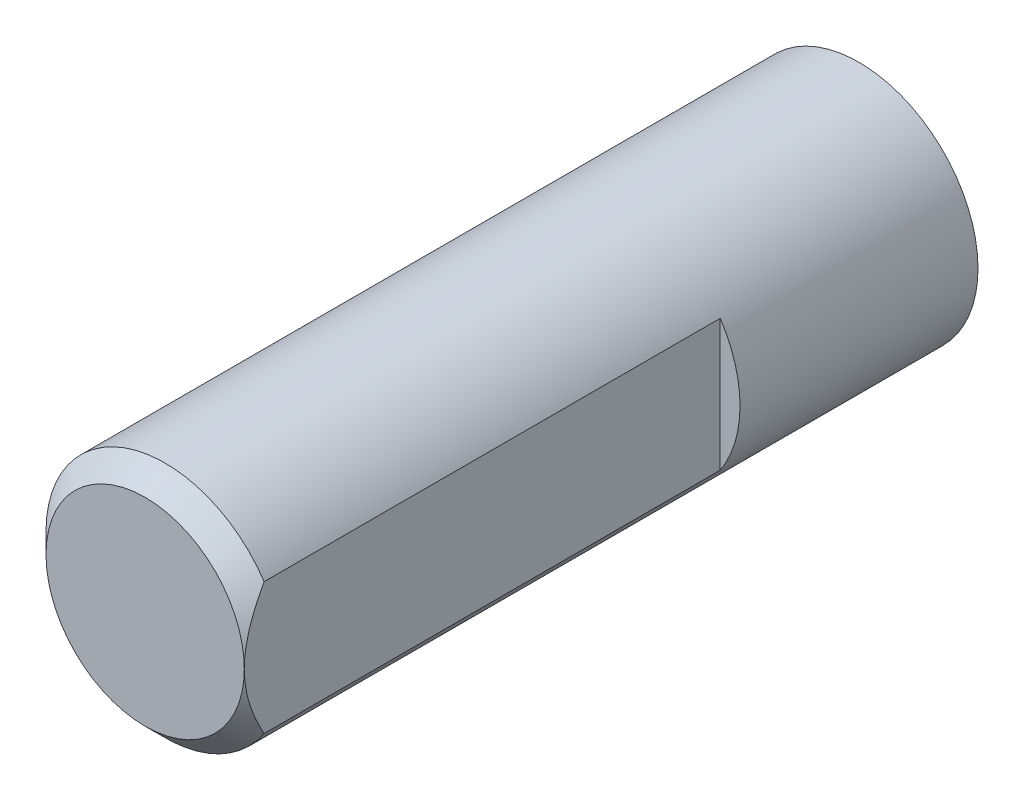
ISO-10303-21;
HEADER;
FILE_DESCRIPTION(('STEP AP214'),'2;1');
FILE_NAME('part.step','',(''),(''),'','','');
FILE_SCHEMA(('AUTOMOTIVE_DESIGN { 1 0 10303 214 1 1 1 1 }'));
ENDSEC;
DATA;
#1=APPLICATION_CONTEXT('core data for automotive mechanical design processes');
#2=APPLICATION_PROTOCOL_DEFINITION('international standard','automotive_design',2000,#1);
#3=PRODUCT_CONTEXT('',#1,'mechanical');
#4=PRODUCT('Part','Part','',(#3));
#5=PRODUCT_RELATED_PRODUCT_CATEGORY('part','',(#4));
#6=PRODUCT_DEFINITION_FORMATION('','',#4);
#7=PRODUCT_DEFINITION_CONTEXT('part definition',#1,'design');
#8=PRODUCT_DEFINITION('design','',#6,#7);
#9=PRODUCT_DEFINITION_SHAPE('','',#8);
#10=(LENGTH_UNIT() NAMED_UNIT(*) SI_UNIT(.MILLI.,.METRE.));
#11=(NAMED_UNIT(*) PLANE_ANGLE_UNIT() SI_UNIT($,.RADIAN.));
#12=(NAMED_UNIT(*) SI_UNIT($,.STERADIAN.) SOLID_ANGLE_UNIT());
#13=UNCERTAINTY_MEASURE_WITH_UNIT(LENGTH_MEASURE(1.E-05),#10,'distance_accuracy_value','');
#14=(GEOMETRIC_REPRESENTATION_CONTEXT(3) GLOBAL_UNCERTAINTY_ASSIGNED_CONTEXT((#13)) GLOBAL_UNIT_ASSIGNED_CONTEXT((#10,
#11,#12)) REPRESENTATION_CONTEXT('',''));
#15=CARTESIAN_POINT('',(0.,0.,0.));
#16=DIRECTION('',(0.,0.,1.));
#17=DIRECTION('',(1.,0.,0.));
#18=AXIS2_PLACEMENT_3D('',#15,#16,#17);
#19=CARTESIAN_POINT('',(0.,0.,18.));
#20=DIRECTION('',(0.,0.,-1.));
#21=DIRECTION('',(-1.,0.,0.));
#22=AXIS2_PLACEMENT_3D('',#19,#20,#21);
#23=CYLINDRICAL_SURFACE('',#22,3.);
#24=DIRECTION('',(0.,0.,1.));
#25=VECTOR('',#24,1.);
#26=CARTESIAN_POINT('',(2.5,-1.6583123951777,6.));
#27=LINE('',#26,#25);
#28=CARTESIAN_POINT('',(2.5,-1.6583123951777,6.));
#29=VERTEX_POINT('',#28);
#30=CARTESIAN_POINT('',(2.5,-1.6583123951777,17.5));
#31=VERTEX_POINT('',#30);
#32=EDGE_CURVE('E84',#29,#31,#27,.T.);
#33=ORIENTED_EDGE('',*,*,#32,.T.);
#34=CARTESIAN_POINT('',(0.,0.,17.5));
#35=DIRECTION('',(0.,0.,1.));
#36=DIRECTION('',(1.,0.,0.));
#37=AXIS2_PLACEMENT_3D('',#34,#35,#36);
#38=CIRCLE('',#37,3.);
#39=CARTESIAN_POINT('',(2.5,1.6583123951777,17.5));
#40=VERTEX_POINT('',#39);
#41=EDGE_CURVE('E11',#31,#40,#38,.F.);
#42=ORIENTED_EDGE('',*,*,#41,.T.);
#43=DIRECTION('',(0.,0.,1.));
#44=VECTOR('',#43,1.);
#45=CARTESIAN_POINT('',(2.5,1.6583123951777,6.));
#46=LINE('',#45,#44);
#47=CARTESIAN_POINT('',(2.5,1.6583123951777,6.));
#48=VERTEX_POINT('',#47);
#49=EDGE_CURVE('E82',#48,#40,#46,.T.);
#50=ORIENTED_EDGE('',*,*,#49,.F.);
#51=CARTESIAN_POINT('',(0.,0.,6.));
#52=DIRECTION('',(0.,0.,1.));
#53=DIRECTION('',(1.,0.,0.));
#54=AXIS2_PLACEMENT_3D('',#51,#52,#53);
#55=CIRCLE('',#54,3.);
#56=EDGE_CURVE('E75',#29,#48,#55,.T.);
#57=ORIENTED_EDGE('',*,*,#56,.F.);
#58=EDGE_LOOP('',(#33,#42,#50,#57));
#59=FACE_BOUND('',#58,.T.);
#60=CARTESIAN_POINT('',(0.,0.,0.));
#61=DIRECTION('',(0.,0.,1.));
#62=DIRECTION('',(1.,0.,0.));
#63=AXIS2_PLACEMENT_3D('',#60,#61,#62);
#64=CIRCLE('',#63,3.);
#65=CARTESIAN_POINT('',(3.,0.,0.));
#66=VERTEX_POINT('',#65);
#67=EDGE_CURVE('E91',#66,#66,#64,.T.);
#68=ORIENTED_EDGE('',*,*,#67,.T.);
#69=EDGE_LOOP('',(#68));
#70=FACE_BOUND('',#69,.T.);
#71=ADVANCED_FACE('F43',(#59,#70),#23,.T.);
#72=CARTESIAN_POINT('',(0.,0.,18.));
#73=DIRECTION('',(0.,0.,1.));
#74=DIRECTION('',(1.,0.,0.));
#75=AXIS2_PLACEMENT_3D('',#72,#73,#74);
#76=PLANE('',#75);
#77=CARTESIAN_POINT('',(0.,0.,18.));
#78=DIRECTION('',(0.,0.,1.));
#79=DIRECTION('',(1.,0.,0.));
#80=AXIS2_PLACEMENT_3D('',#77,#78,#79);
#81=CIRCLE('',#80,2.5);
#82=CARTESIAN_POINT('',(2.5,0.,18.));
#83=VERTEX_POINT('',#82);
#84=EDGE_CURVE('E97',#83,#83,#81,.T.);
#85=ORIENTED_EDGE('',*,*,#84,.T.);
#86=EDGE_LOOP('',(#85));
#87=FACE_BOUND('',#86,.T.);
#88=ADVANCED_FACE('F117',(#87),#76,.T.);
#89=CARTESIAN_POINT('',(0.,0.,0.));
#90=DIRECTION('',(0.,0.,1.));
#91=DIRECTION('',(1.,0.,0.));
#92=AXIS2_PLACEMENT_3D('',#89,#90,#91);
#93=PLANE('',#92);
#94=ORIENTED_EDGE('',*,*,#67,.F.);
#95=EDGE_LOOP('',(#94));
#96=FACE_BOUND('',#95,.T.);
#97=ADVANCED_FACE('F116',(#96),#93,.F.);
#98=CARTESIAN_POINT('',(2.5,1.6583123951777,6.));
#99=DIRECTION('',(-1.,0.,0.));
#100=DIRECTION('',(0.,0.,1.));
#101=AXIS2_PLACEMENT_3D('',#98,#99,#100);
#102=PLANE('',#101);
#103=CARTESIAN_POINT('',(2.5,1.6583123951777,17.5));
#104=CARTESIAN_POINT('',(2.5,1.61304419071273,17.5250200255843));
#105=CARTESIAN_POINT('',(2.5,1.56747781751027,17.549499427219));
#106=CARTESIAN_POINT('',(2.5,1.47571363154993,17.5972096867305));
#107=CARTESIAN_POINT('',(2.5,1.42951600534284,17.6204409038781));
#108=CARTESIAN_POINT('',(2.5,1.28946898250347,17.688233741468));
#109=CARTESIAN_POINT('',(2.5,1.19456817295725,17.7306685534991));
#110=CARTESIAN_POINT('',(2.5,1.00435832661106,17.8071641313579));
#111=CARTESIAN_POINT('',(2.5,0.909128166857117,17.8414185932365));
#112=CARTESIAN_POINT('',(2.5,0.715960996402805,17.9011186383457));
#113=CARTESIAN_POINT('',(2.5,0.618025975916641,17.9265705213043));
#114=CARTESIAN_POINT('',(2.5,0.434096531038007,17.96395141614));
#115=CARTESIAN_POINT('',(2.5,0.348395131920399,17.9772928993308));
#116=CARTESIAN_POINT('',(2.5,0.218706232970867,17.9908266543301));
#117=CARTESIAN_POINT('',(2.5,0.17504227488708,17.9942588205655));
#118=CARTESIAN_POINT('',(2.5,0.0875881850216987,17.9988484547413));
#119=CARTESIAN_POINT('',(2.5,0.0437980337548226,18.0000055502065));
#120=CARTESIAN_POINT('',(2.5,0.,18.));
#121=B_SPLINE_CURVE_WITH_KNOTS('',3,(#103,#104,#105,#106,#107,#108,#109,#110,#111,#112,#113,
#114,#115,#116,#117,#118,#119,#120),.UNSPECIFIED.,.F.,.F.,(4,2,2,2,2,2,2,2,4),(0.,
0.155160114661541,0.310275326953931,0.621889187467566,0.925164565305232,1.22822244720193,
1.48798349653102,1.61932602447731,1.75069005406606),.UNSPECIFIED.);
#122=EDGE_CURVE('E101',#40,#83,#121,.T.);
#123=ORIENTED_EDGE('',*,*,#122,.T.);
#124=CARTESIAN_POINT('',(2.5,0.,18.));
#125=CARTESIAN_POINT('',(2.5,-0.0768428391803913,18.0000643176381));
#126=CARTESIAN_POINT('',(2.5,-0.153646619440305,17.9964585669139));
#127=CARTESIAN_POINT('',(2.5,-0.306486913990631,17.9824138186156));
#128=CARTESIAN_POINT('',(2.5,-0.382524604614592,17.9719877566791));
#129=CARTESIAN_POINT('',(2.5,-0.532231201598342,17.9450231886171));
#130=CARTESIAN_POINT('',(2.5,-0.605918543015126,17.9285851348585));
#131=CARTESIAN_POINT('',(2.5,-0.751897163106768,17.8903277696489));
#132=CARTESIAN_POINT('',(2.5,-0.824187885624652,17.8685063602176));
#133=CARTESIAN_POINT('',(2.5,-0.961361204559369,17.8222417065684));
#134=CARTESIAN_POINT('',(2.5,-1.02636662586387,17.7981581621012));
#135=CARTESIAN_POINT('',(2.5,-1.15505562355539,17.7466971992364));
#136=CARTESIAN_POINT('',(2.5,-1.21873914323977,17.7193196398836));
#137=CARTESIAN_POINT('',(2.5,-1.34581351001767,17.6613450460911));
#138=CARTESIAN_POINT('',(2.5,-1.40918435962136,17.6307045192353));
#139=CARTESIAN_POINT('',(2.5,-1.53466113602633,17.567035036112));
#140=CARTESIAN_POINT('',(2.5,-1.59676793059763,17.5340077944289));
#141=CARTESIAN_POINT('',(2.5,-1.6583123951777,17.5));
#142=B_SPLINE_CURVE_WITH_KNOTS('',3,(#124,#125,#126,#127,#128,#129,#130,#131,#132,#133,#134,
#135,#136,#137,#138,#139,#140,#141),.UNSPECIFIED.,.F.,.F.,(4,2,2,2,2,2,2,2,4),(0.,
0.230381722715165,0.460327757459297,0.686595219702824,0.912951001700758,1.120819357645,
1.32869661170077,1.53981070703046,1.75077462023261),.UNSPECIFIED.);
#143=EDGE_CURVE('E53',#83,#31,#142,.T.);
#144=ORIENTED_EDGE('',*,*,#143,.T.);
#145=ORIENTED_EDGE('',*,*,#32,.F.);
#146=DIRECTION('',(0.,-1.,0.));
#147=VECTOR('',#146,1.);
#148=CARTESIAN_POINT('',(2.5,1.6583123951777,6.));
#149=LINE('',#148,#147);
#150=EDGE_CURVE('E78',#48,#29,#149,.T.);
#151=ORIENTED_EDGE('',*,*,#150,.F.);
#152=ORIENTED_EDGE('',*,*,#49,.T.);
#153=EDGE_LOOP('',(#123,#144,#145,#151,#152));
#154=FACE_BOUND('',#153,.T.);
#155=ADVANCED_FACE('F81',(#154),#102,.F.);
#156=CARTESIAN_POINT('',(0.,0.,6.));
#157=DIRECTION('',(0.,0.,1.));
#158=DIRECTION('',(1.,0.,0.));
#159=AXIS2_PLACEMENT_3D('',#156,#157,#158);
#160=PLANE('',#159);
#161=ORIENTED_EDGE('',*,*,#56,.T.);
#162=ORIENTED_EDGE('',*,*,#150,.T.);
#163=EDGE_LOOP('',(#161,#162));
#164=FACE_BOUND('',#163,.T.);
#165=ADVANCED_FACE('F77',(#164),#160,.T.);
#166=CARTESIAN_POINT('',(0.,0.,18.));
#167=DIRECTION('',(0.,0.,-1.));
#168=DIRECTION('',(-1.,0.,0.));
#169=AXIS2_PLACEMENT_3D('',#166,#167,#168);
#170=CONICAL_SURFACE('',#169,2.5,0.78539816339745);
#171=ORIENTED_EDGE('',*,*,#122,.F.);
#172=ORIENTED_EDGE('',*,*,#41,.F.);
#173=ORIENTED_EDGE('',*,*,#143,.F.);
#174=ORIENTED_EDGE('',*,*,#84,.F.);
#175=EDGE_LOOP('',(#171,#172,#173,#174));
#176=FACE_BOUND('',#175,.T.);
#177=ADVANCED_FACE('F45',(#176),#170,.T.);
#178=CLOSED_SHELL('',(#71,#88,#97,#155,#165,#177));
#179=MANIFOLD_SOLID_BREP('B2',#178);
#180=ADVANCED_BREP_SHAPE_REPRESENTATION('',(#18,#179),#14);
#181=SHAPE_DEFINITION_REPRESENTATION(#9,#180);
ENDSEC;
END-ISO-10303-21;
